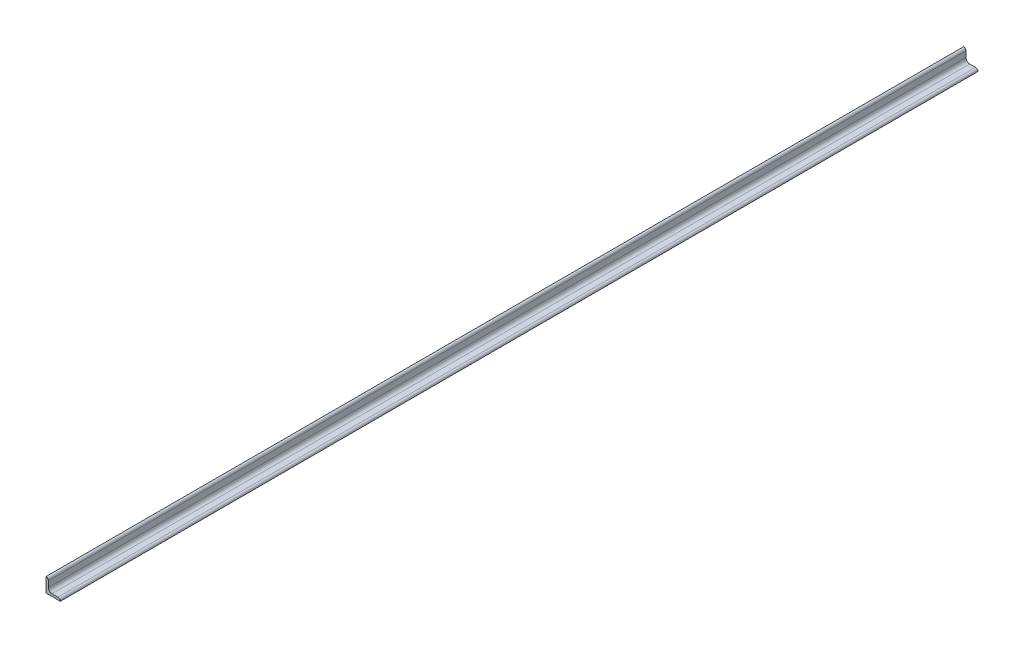
ISO-10303-21;
HEADER;
FILE_DESCRIPTION(('STEP AP214'),'2;1');
FILE_NAME('part.step','',(''),(''),'','','');
FILE_SCHEMA(('AUTOMOTIVE_DESIGN { 1 0 10303 214 1 1 1 1 }'));
ENDSEC;
DATA;
#1=APPLICATION_CONTEXT('core data for automotive mechanical design processes');
#2=APPLICATION_PROTOCOL_DEFINITION('international standard','automotive_design',2000,#1);
#3=PRODUCT_CONTEXT('',#1,'mechanical');
#4=PRODUCT('Part','Part','',(#3));
#5=PRODUCT_RELATED_PRODUCT_CATEGORY('part','',(#4));
#6=PRODUCT_DEFINITION_FORMATION('','',#4);
#7=PRODUCT_DEFINITION_CONTEXT('part definition',#1,'design');
#8=PRODUCT_DEFINITION('design','',#6,#7);
#9=PRODUCT_DEFINITION_SHAPE('','',#8);
#10=(LENGTH_UNIT() NAMED_UNIT(*) SI_UNIT(.MILLI.,.METRE.));
#11=(NAMED_UNIT(*) PLANE_ANGLE_UNIT() SI_UNIT($,.RADIAN.));
#12=(NAMED_UNIT(*) SI_UNIT($,.STERADIAN.) SOLID_ANGLE_UNIT());
#13=UNCERTAINTY_MEASURE_WITH_UNIT(LENGTH_MEASURE(1.E-05),#10,'distance_accuracy_value','');
#14=(GEOMETRIC_REPRESENTATION_CONTEXT(3) GLOBAL_UNCERTAINTY_ASSIGNED_CONTEXT((#13)) GLOBAL_UNIT_ASSIGNED_CONTEXT((#10,
#11,#12)) REPRESENTATION_CONTEXT('',''));
#15=CARTESIAN_POINT('',(0.,0.,0.));
#16=DIRECTION('',(0.,0.,1.));
#17=DIRECTION('',(1.,0.,0.));
#18=AXIS2_PLACEMENT_3D('',#15,#16,#17);
#19=CARTESIAN_POINT('',(19.05,0.,609.6));
#20=DIRECTION('',(0.,1.,0.));
#21=DIRECTION('',(-1.,0.,0.));
#22=AXIS2_PLACEMENT_3D('',#19,#20,#21);
#23=PLANE('',#22);
#24=DIRECTION('',(1.,0.,0.));
#25=VECTOR('',#24,1.);
#26=CARTESIAN_POINT('',(19.05,0.,-609.6));
#27=LINE('',#26,#25);
#28=CARTESIAN_POINT('',(0.,0.,-609.6));
#29=VERTEX_POINT('',#28);
#30=CARTESIAN_POINT('',(19.05,0.,-609.6));
#31=VERTEX_POINT('',#30);
#32=EDGE_CURVE('E135',#29,#31,#27,.T.);
#33=ORIENTED_EDGE('',*,*,#32,.T.);
#34=DIRECTION('',(0.,0.,-1.));
#35=VECTOR('',#34,1.);
#36=CARTESIAN_POINT('',(19.05,0.,609.6));
#37=LINE('',#36,#35);
#38=CARTESIAN_POINT('',(19.05,0.,609.6));
#39=VERTEX_POINT('',#38);
#40=EDGE_CURVE('E11',#39,#31,#37,.T.);
#41=ORIENTED_EDGE('',*,*,#40,.F.);
#42=DIRECTION('',(1.,0.,0.));
#43=VECTOR('',#42,1.);
#44=CARTESIAN_POINT('',(19.05,0.,609.6));
#45=LINE('',#44,#43);
#46=CARTESIAN_POINT('',(0.,0.,609.6));
#47=VERTEX_POINT('',#46);
#48=EDGE_CURVE('E151',#47,#39,#45,.T.);
#49=ORIENTED_EDGE('',*,*,#48,.F.);
#50=DIRECTION('',(0.,0.,-1.));
#51=VECTOR('',#50,1.);
#52=CARTESIAN_POINT('',(0.,0.,609.6));
#53=LINE('',#52,#51);
#54=EDGE_CURVE('E131',#47,#29,#53,.T.);
#55=ORIENTED_EDGE('',*,*,#54,.T.);
#56=EDGE_LOOP('',(#33,#41,#49,#55));
#57=FACE_BOUND('',#56,.T.);
#58=ADVANCED_FACE('F33',(#57),#23,.F.);
#59=CARTESIAN_POINT('',(19.05,0.00507999999999611,609.6));
#60=DIRECTION('',(-1.,0.,0.));
#61=DIRECTION('',(0.,0.,1.));
#62=AXIS2_PLACEMENT_3D('',#59,#60,#61);
#63=PLANE('',#62);
#64=DIRECTION('',(0.,1.,0.));
#65=VECTOR('',#64,1.);
#66=CARTESIAN_POINT('',(19.05,0.00507999999999611,-609.6));
#67=LINE('',#66,#65);
#68=CARTESIAN_POINT('',(19.05,0.00507999999999611,-609.6));
#69=VERTEX_POINT('',#68);
#70=EDGE_CURVE('E138',#31,#69,#67,.T.);
#71=ORIENTED_EDGE('',*,*,#70,.T.);
#72=DIRECTION('',(0.,0.,-1.));
#73=VECTOR('',#72,1.);
#74=CARTESIAN_POINT('',(19.05,0.00507999999999611,609.6));
#75=LINE('',#74,#73);
#76=CARTESIAN_POINT('',(19.05,0.00507999999999611,609.6));
#77=VERTEX_POINT('',#76);
#78=EDGE_CURVE('E41',#77,#69,#75,.T.);
#79=ORIENTED_EDGE('',*,*,#78,.F.);
#80=DIRECTION('',(0.,1.,0.));
#81=VECTOR('',#80,1.);
#82=CARTESIAN_POINT('',(19.05,0.00507999999999611,609.6));
#83=LINE('',#82,#81);
#84=EDGE_CURVE('E95',#39,#77,#83,.T.);
#85=ORIENTED_EDGE('',*,*,#84,.F.);
#86=ORIENTED_EDGE('',*,*,#40,.T.);
#87=EDGE_LOOP('',(#71,#79,#85,#86));
#88=FACE_BOUND('',#87,.T.);
#89=ADVANCED_FACE('F194',(#88),#63,.F.);
#90=CARTESIAN_POINT('',(15.88008,0.00507999999999573,609.6));
#91=DIRECTION('',(0.,0.,-1.));
#92=DIRECTION('',(-1.,0.,0.));
#93=AXIS2_PLACEMENT_3D('',#90,#91,#92);
#94=CYLINDRICAL_SURFACE('',#93,3.16992);
#95=CARTESIAN_POINT('',(15.88008,0.00507999999999573,-609.6));
#96=DIRECTION('',(0.,0.,1.));
#97=DIRECTION('',(1.,0.,0.));
#98=AXIS2_PLACEMENT_3D('',#95,#96,#97);
#99=CIRCLE('',#98,3.16992);
#100=CARTESIAN_POINT('',(15.88008,3.17499999999999,-609.6));
#101=VERTEX_POINT('',#100);
#102=EDGE_CURVE('E140',#69,#101,#99,.T.);
#103=ORIENTED_EDGE('',*,*,#102,.T.);
#104=DIRECTION('',(0.,0.,-1.));
#105=VECTOR('',#104,1.);
#106=CARTESIAN_POINT('',(15.88008,3.17499999999999,609.6));
#107=LINE('',#106,#105);
#108=CARTESIAN_POINT('',(15.88008,3.17499999999999,609.6));
#109=VERTEX_POINT('',#108);
#110=EDGE_CURVE('E161',#109,#101,#107,.T.);
#111=ORIENTED_EDGE('',*,*,#110,.F.);
#112=CARTESIAN_POINT('',(15.88008,0.00507999999999573,609.6));
#113=DIRECTION('',(0.,0.,1.));
#114=DIRECTION('',(1.,0.,0.));
#115=AXIS2_PLACEMENT_3D('',#112,#113,#114);
#116=CIRCLE('',#115,3.16992);
#117=EDGE_CURVE('E169',#77,#109,#116,.T.);
#118=ORIENTED_EDGE('',*,*,#117,.F.);
#119=ORIENTED_EDGE('',*,*,#78,.T.);
#120=EDGE_LOOP('',(#103,#111,#118,#119));
#121=FACE_BOUND('',#120,.T.);
#122=ADVANCED_FACE('F167',(#121),#94,.T.);
#123=CARTESIAN_POINT('',(7.93749999999999,3.175,609.6));
#124=DIRECTION('',(0.,-1.,0.));
#125=DIRECTION('',(1.,0.,0.));
#126=AXIS2_PLACEMENT_3D('',#123,#124,#125);
#127=PLANE('',#126);
#128=DIRECTION('',(-1.,0.,0.));
#129=VECTOR('',#128,1.);
#130=CARTESIAN_POINT('',(7.93749999999999,3.175,-609.6));
#131=LINE('',#130,#129);
#132=CARTESIAN_POINT('',(7.93749999999999,3.17499999999999,-609.6));
#133=VERTEX_POINT('',#132);
#134=EDGE_CURVE('E142',#101,#133,#131,.T.);
#135=ORIENTED_EDGE('',*,*,#134,.T.);
#136=DIRECTION('',(0.,0.,-1.));
#137=VECTOR('',#136,1.);
#138=CARTESIAN_POINT('',(7.93749999999999,3.17499999999999,609.6));
#139=LINE('',#138,#137);
#140=CARTESIAN_POINT('',(7.93749999999999,3.17499999999999,609.6));
#141=VERTEX_POINT('',#140);
#142=EDGE_CURVE('E158',#141,#133,#139,.T.);
#143=ORIENTED_EDGE('',*,*,#142,.F.);
#144=DIRECTION('',(-1.,0.,0.));
#145=VECTOR('',#144,1.);
#146=CARTESIAN_POINT('',(7.93749999999999,3.175,609.6));
#147=LINE('',#146,#145);
#148=EDGE_CURVE('E185',#109,#141,#147,.T.);
#149=ORIENTED_EDGE('',*,*,#148,.F.);
#150=ORIENTED_EDGE('',*,*,#110,.T.);
#151=EDGE_LOOP('',(#135,#143,#149,#150));
#152=FACE_BOUND('',#151,.T.);
#153=ADVANCED_FACE('F178',(#152),#127,.F.);
#154=CARTESIAN_POINT('',(7.93749999999999,7.93749999999999,609.6));
#155=DIRECTION('',(0.,0.,-1.));
#156=DIRECTION('',(-1.,0.,0.));
#157=AXIS2_PLACEMENT_3D('',#154,#155,#156);
#158=CYLINDRICAL_SURFACE('',#157,4.7625);
#159=CARTESIAN_POINT('',(7.93749999999999,7.93749999999999,-609.6));
#160=DIRECTION('',(0.,0.,-1.));
#161=DIRECTION('',(-1.,0.,0.));
#162=AXIS2_PLACEMENT_3D('',#159,#160,#161);
#163=CIRCLE('',#162,4.7625);
#164=CARTESIAN_POINT('',(3.17499999999999,7.93749999999999,-609.6));
#165=VERTEX_POINT('',#164);
#166=EDGE_CURVE('E144',#133,#165,#163,.T.);
#167=ORIENTED_EDGE('',*,*,#166,.T.);
#168=DIRECTION('',(0.,0.,-1.));
#169=VECTOR('',#168,1.);
#170=CARTESIAN_POINT('',(3.17499999999999,7.93749999999999,609.6));
#171=LINE('',#170,#169);
#172=CARTESIAN_POINT('',(3.17499999999999,7.93749999999999,609.6));
#173=VERTEX_POINT('',#172);
#174=EDGE_CURVE('E155',#173,#165,#171,.T.);
#175=ORIENTED_EDGE('',*,*,#174,.F.);
#176=CARTESIAN_POINT('',(7.93749999999999,7.93749999999999,609.6));
#177=DIRECTION('',(0.,0.,-1.));
#178=DIRECTION('',(-1.,0.,0.));
#179=AXIS2_PLACEMENT_3D('',#176,#177,#178);
#180=CIRCLE('',#179,4.7625);
#181=EDGE_CURVE('E184',#141,#173,#180,.T.);
#182=ORIENTED_EDGE('',*,*,#181,.F.);
#183=ORIENTED_EDGE('',*,*,#142,.T.);
#184=EDGE_LOOP('',(#167,#175,#182,#183));
#185=FACE_BOUND('',#184,.T.);
#186=ADVANCED_FACE('F182',(#185),#158,.F.);
#187=CARTESIAN_POINT('',(3.175,15.88008,609.6));
#188=DIRECTION('',(-1.,0.,0.));
#189=DIRECTION('',(0.,-1.,0.));
#190=AXIS2_PLACEMENT_3D('',#187,#188,#189);
#191=PLANE('',#190);
#192=DIRECTION('',(0.,1.,0.));
#193=VECTOR('',#192,1.);
#194=CARTESIAN_POINT('',(3.175,15.88008,-609.6));
#195=LINE('',#194,#193);
#196=CARTESIAN_POINT('',(3.17500000000001,15.88008,-609.6));
#197=VERTEX_POINT('',#196);
#198=EDGE_CURVE('E146',#165,#197,#195,.T.);
#199=ORIENTED_EDGE('',*,*,#198,.T.);
#200=DIRECTION('',(0.,0.,-1.));
#201=VECTOR('',#200,1.);
#202=CARTESIAN_POINT('',(3.17500000000001,15.88008,609.6));
#203=LINE('',#202,#201);
#204=CARTESIAN_POINT('',(3.17500000000001,15.88008,609.6));
#205=VERTEX_POINT('',#204);
#206=EDGE_CURVE('E126',#205,#197,#203,.T.);
#207=ORIENTED_EDGE('',*,*,#206,.F.);
#208=DIRECTION('',(0.,1.,0.));
#209=VECTOR('',#208,1.);
#210=CARTESIAN_POINT('',(3.175,15.88008,609.6));
#211=LINE('',#210,#209);
#212=EDGE_CURVE('E117',#173,#205,#211,.T.);
#213=ORIENTED_EDGE('',*,*,#212,.F.);
#214=ORIENTED_EDGE('',*,*,#174,.T.);
#215=EDGE_LOOP('',(#199,#207,#213,#214));
#216=FACE_BOUND('',#215,.T.);
#217=ADVANCED_FACE('F206',(#216),#191,.F.);
#218=CARTESIAN_POINT('',(0.00508000000000019,15.88008,609.6));
#219=DIRECTION('',(0.,0.,-1.));
#220=DIRECTION('',(-1.,0.,0.));
#221=AXIS2_PLACEMENT_3D('',#218,#219,#220);
#222=CYLINDRICAL_SURFACE('',#221,3.16992);
#223=CARTESIAN_POINT('',(0.00508000000000019,15.88008,-609.6));
#224=DIRECTION('',(0.,0.,1.));
#225=DIRECTION('',(-1.,0.,0.));
#226=AXIS2_PLACEMENT_3D('',#223,#224,#225);
#227=CIRCLE('',#226,3.16992);
#228=CARTESIAN_POINT('',(0.00508,19.05,-609.6));
#229=VERTEX_POINT('',#228);
#230=EDGE_CURVE('E125',#197,#229,#227,.T.);
#231=ORIENTED_EDGE('',*,*,#230,.T.);
#232=DIRECTION('',(0.,0.,-1.));
#233=VECTOR('',#232,1.);
#234=CARTESIAN_POINT('',(0.00508,19.05,609.6));
#235=LINE('',#234,#233);
#236=CARTESIAN_POINT('',(0.00508,19.05,609.6));
#237=VERTEX_POINT('',#236);
#238=EDGE_CURVE('E122',#237,#229,#235,.T.);
#239=ORIENTED_EDGE('',*,*,#238,.F.);
#240=CARTESIAN_POINT('',(0.00508000000000019,15.88008,609.6));
#241=DIRECTION('',(0.,0.,1.));
#242=DIRECTION('',(-1.,0.,0.));
#243=AXIS2_PLACEMENT_3D('',#240,#241,#242);
#244=CIRCLE('',#243,3.16992);
#245=EDGE_CURVE('E111',#205,#237,#244,.T.);
#246=ORIENTED_EDGE('',*,*,#245,.F.);
#247=ORIENTED_EDGE('',*,*,#206,.T.);
#248=EDGE_LOOP('',(#231,#239,#246,#247));
#249=FACE_BOUND('',#248,.T.);
#250=ADVANCED_FACE('F123',(#249),#222,.T.);
#251=CARTESIAN_POINT('',(0.,19.05,609.6));
#252=DIRECTION('',(0.,-1.,0.));
#253=DIRECTION('',(0.,0.,-1.));
#254=AXIS2_PLACEMENT_3D('',#251,#252,#253);
#255=PLANE('',#254);
#256=DIRECTION('',(-1.,0.,0.));
#257=VECTOR('',#256,1.);
#258=CARTESIAN_POINT('',(0.,19.05,-609.6));
#259=LINE('',#258,#257);
#260=CARTESIAN_POINT('',(0.,19.05,-609.6));
#261=VERTEX_POINT('',#260);
#262=EDGE_CURVE('E81',#229,#261,#259,.T.);
#263=ORIENTED_EDGE('',*,*,#262,.T.);
#264=DIRECTION('',(0.,0.,-1.));
#265=VECTOR('',#264,1.);
#266=CARTESIAN_POINT('',(0.,19.05,609.6));
#267=LINE('',#266,#265);
#268=CARTESIAN_POINT('',(0.,19.05,609.6));
#269=VERTEX_POINT('',#268);
#270=EDGE_CURVE('E127',#269,#261,#267,.T.);
#271=ORIENTED_EDGE('',*,*,#270,.F.);
#272=DIRECTION('',(-1.,0.,0.));
#273=VECTOR('',#272,1.);
#274=CARTESIAN_POINT('',(0.,19.05,609.6));
#275=LINE('',#274,#273);
#276=EDGE_CURVE('E115',#237,#269,#275,.T.);
#277=ORIENTED_EDGE('',*,*,#276,.F.);
#278=ORIENTED_EDGE('',*,*,#238,.T.);
#279=EDGE_LOOP('',(#263,#271,#277,#278));
#280=FACE_BOUND('',#279,.T.);
#281=ADVANCED_FACE('F129',(#280),#255,.F.);
#282=CARTESIAN_POINT('',(0.,0.,609.6));
#283=DIRECTION('',(1.,0.,0.));
#284=DIRECTION('',(0.,1.,0.));
#285=AXIS2_PLACEMENT_3D('',#282,#283,#284);
#286=PLANE('',#285);
#287=DIRECTION('',(0.,-1.,0.));
#288=VECTOR('',#287,1.);
#289=CARTESIAN_POINT('',(0.,0.,-609.6));
#290=LINE('',#289,#288);
#291=EDGE_CURVE('E87',#261,#29,#290,.T.);
#292=ORIENTED_EDGE('',*,*,#291,.T.);
#293=ORIENTED_EDGE('',*,*,#54,.F.);
#294=DIRECTION('',(0.,-1.,0.));
#295=VECTOR('',#294,1.);
#296=CARTESIAN_POINT('',(0.,0.,609.6));
#297=LINE('',#296,#295);
#298=EDGE_CURVE('E49',#269,#47,#297,.T.);
#299=ORIENTED_EDGE('',*,*,#298,.F.);
#300=ORIENTED_EDGE('',*,*,#270,.T.);
#301=EDGE_LOOP('',(#292,#293,#299,#300));
#302=FACE_BOUND('',#301,.T.);
#303=ADVANCED_FACE('F214',(#302),#286,.F.);
#304=CARTESIAN_POINT('',(0.00508000000000019,15.88008,609.6));
#305=DIRECTION('',(0.,0.,-1.));
#306=DIRECTION('',(-1.,0.,0.));
#307=AXIS2_PLACEMENT_3D('',#304,#305,#306);
#308=PLANE('',#307);
#309=ORIENTED_EDGE('',*,*,#48,.T.);
#310=ORIENTED_EDGE('',*,*,#84,.T.);
#311=ORIENTED_EDGE('',*,*,#117,.T.);
#312=ORIENTED_EDGE('',*,*,#148,.T.);
#313=ORIENTED_EDGE('',*,*,#181,.T.);
#314=ORIENTED_EDGE('',*,*,#212,.T.);
#315=ORIENTED_EDGE('',*,*,#245,.T.);
#316=ORIENTED_EDGE('',*,*,#276,.T.);
#317=ORIENTED_EDGE('',*,*,#298,.T.);
#318=EDGE_LOOP('',(#309,#310,#311,#312,#313,#314,#315,#316,#317));
#319=FACE_BOUND('',#318,.T.);
#320=ADVANCED_FACE('F113',(#319),#308,.F.);
#321=CARTESIAN_POINT('',(0.00508000000000019,15.88008,-609.6));
#322=DIRECTION('',(0.,0.,-1.));
#323=DIRECTION('',(-1.,0.,0.));
#324=AXIS2_PLACEMENT_3D('',#321,#322,#323);
#325=PLANE('',#324);
#326=ORIENTED_EDGE('',*,*,#32,.F.);
#327=ORIENTED_EDGE('',*,*,#291,.F.);
#328=ORIENTED_EDGE('',*,*,#262,.F.);
#329=ORIENTED_EDGE('',*,*,#230,.F.);
#330=ORIENTED_EDGE('',*,*,#198,.F.);
#331=ORIENTED_EDGE('',*,*,#166,.F.);
#332=ORIENTED_EDGE('',*,*,#134,.F.);
#333=ORIENTED_EDGE('',*,*,#102,.F.);
#334=ORIENTED_EDGE('',*,*,#70,.F.);
#335=EDGE_LOOP('',(#326,#327,#328,#329,#330,#331,#332,#333,#334));
#336=FACE_BOUND('',#335,.T.);
#337=ADVANCED_FACE('F173',(#336),#325,.T.);
#338=CLOSED_SHELL('',(#58,#89,#122,#153,#186,#217,#250,#281,#303,#320,#337));
#339=MANIFOLD_SOLID_BREP('B2',#338);
#340=ADVANCED_BREP_SHAPE_REPRESENTATION('',(#18,#339),#14);
#341=SHAPE_DEFINITION_REPRESENTATION(#9,#340);
ENDSEC;
END-ISO-10303-21;
